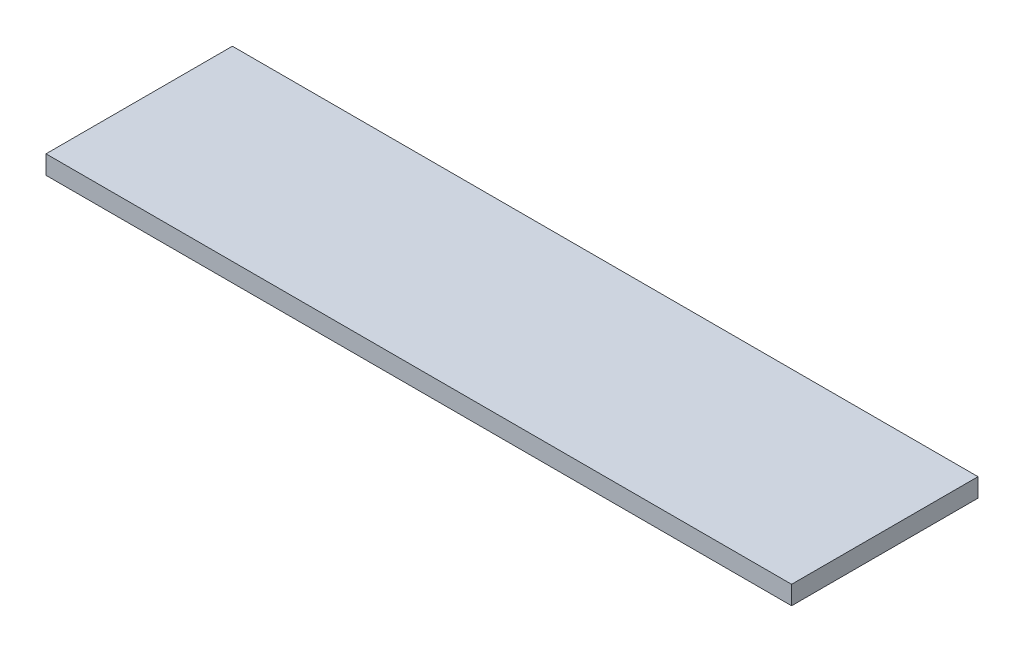
ISO-10303-21;
HEADER;
FILE_DESCRIPTION(('STEP AP214'),'2;1');
FILE_NAME('part.step','',(''),(''),'','','');
FILE_SCHEMA(('AUTOMOTIVE_DESIGN { 1 0 10303 214 1 1 1 1 }'));
ENDSEC;
DATA;
#1=APPLICATION_CONTEXT('core data for automotive mechanical design processes');
#2=APPLICATION_PROTOCOL_DEFINITION('international standard','automotive_design',2000,#1);
#3=PRODUCT_CONTEXT('',#1,'mechanical');
#4=PRODUCT('Part','Part','',(#3));
#5=PRODUCT_RELATED_PRODUCT_CATEGORY('part','',(#4));
#6=PRODUCT_DEFINITION_FORMATION('','',#4);
#7=PRODUCT_DEFINITION_CONTEXT('part definition',#1,'design');
#8=PRODUCT_DEFINITION('design','',#6,#7);
#9=PRODUCT_DEFINITION_SHAPE('','',#8);
#10=(LENGTH_UNIT() NAMED_UNIT(*) SI_UNIT(.MILLI.,.METRE.));
#11=(NAMED_UNIT(*) PLANE_ANGLE_UNIT() SI_UNIT($,.RADIAN.));
#12=(NAMED_UNIT(*) SI_UNIT($,.STERADIAN.) SOLID_ANGLE_UNIT());
#13=UNCERTAINTY_MEASURE_WITH_UNIT(LENGTH_MEASURE(1.E-05),#10,'distance_accuracy_value','');
#14=(GEOMETRIC_REPRESENTATION_CONTEXT(3) GLOBAL_UNCERTAINTY_ASSIGNED_CONTEXT((#13)) GLOBAL_UNIT_ASSIGNED_CONTEXT((#10,
#11,#12)) REPRESENTATION_CONTEXT('',''));
#15=CARTESIAN_POINT('',(0.,0.,0.));
#16=DIRECTION('',(0.,0.,1.));
#17=DIRECTION('',(1.,0.,0.));
#18=AXIS2_PLACEMENT_3D('',#15,#16,#17);
#19=CARTESIAN_POINT('',(400.,20.,-100.));
#20=DIRECTION('',(-1.,0.,0.));
#21=DIRECTION('',(0.,0.,1.));
#22=AXIS2_PLACEMENT_3D('',#19,#20,#21);
#23=PLANE('',#22);
#24=DIRECTION('',(0.,0.,-1.));
#25=VECTOR('',#24,1.);
#26=CARTESIAN_POINT('',(400.,0.,-100.));
#27=LINE('',#26,#25);
#28=CARTESIAN_POINT('',(400.,0.,100.));
#29=VERTEX_POINT('',#28);
#30=CARTESIAN_POINT('',(400.,0.,-100.));
#31=VERTEX_POINT('',#30);
#32=EDGE_CURVE('E100',#29,#31,#27,.T.);
#33=ORIENTED_EDGE('',*,*,#32,.T.);
#34=DIRECTION('',(0.,-1.,0.));
#35=VECTOR('',#34,1.);
#36=CARTESIAN_POINT('',(400.,20.,-100.));
#37=LINE('',#36,#35);
#38=CARTESIAN_POINT('',(400.,20.,-100.));
#39=VERTEX_POINT('',#38);
#40=EDGE_CURVE('E11',#39,#31,#37,.T.);
#41=ORIENTED_EDGE('',*,*,#40,.F.);
#42=DIRECTION('',(0.,0.,-1.));
#43=VECTOR('',#42,1.);
#44=CARTESIAN_POINT('',(400.,20.,-100.));
#45=LINE('',#44,#43);
#46=CARTESIAN_POINT('',(400.,20.,100.));
#47=VERTEX_POINT('',#46);
#48=EDGE_CURVE('E88',#47,#39,#45,.T.);
#49=ORIENTED_EDGE('',*,*,#48,.F.);
#50=DIRECTION('',(0.,-1.,0.));
#51=VECTOR('',#50,1.);
#52=CARTESIAN_POINT('',(400.,20.,100.));
#53=LINE('',#52,#51);
#54=EDGE_CURVE('E96',#47,#29,#53,.T.);
#55=ORIENTED_EDGE('',*,*,#54,.T.);
#56=EDGE_LOOP('',(#33,#41,#49,#55));
#57=FACE_BOUND('',#56,.T.);
#58=ADVANCED_FACE('F37',(#57),#23,.F.);
#59=CARTESIAN_POINT('',(-400.,20.,-100.));
#60=DIRECTION('',(0.,0.,1.));
#61=DIRECTION('',(1.,0.,0.));
#62=AXIS2_PLACEMENT_3D('',#59,#60,#61);
#63=PLANE('',#62);
#64=DIRECTION('',(-1.,0.,0.));
#65=VECTOR('',#64,1.);
#66=CARTESIAN_POINT('',(-400.,0.,-100.));
#67=LINE('',#66,#65);
#68=CARTESIAN_POINT('',(-400.,0.,-100.));
#69=VERTEX_POINT('',#68);
#70=EDGE_CURVE('E92',#31,#69,#67,.T.);
#71=ORIENTED_EDGE('',*,*,#70,.T.);
#72=DIRECTION('',(0.,-1.,0.));
#73=VECTOR('',#72,1.);
#74=CARTESIAN_POINT('',(-400.,20.,-100.));
#75=LINE('',#74,#73);
#76=CARTESIAN_POINT('',(-400.,20.,-100.));
#77=VERTEX_POINT('',#76);
#78=EDGE_CURVE('E45',#77,#69,#75,.T.);
#79=ORIENTED_EDGE('',*,*,#78,.F.);
#80=DIRECTION('',(-1.,0.,0.));
#81=VECTOR('',#80,1.);
#82=CARTESIAN_POINT('',(-400.,20.,-100.));
#83=LINE('',#82,#81);
#84=EDGE_CURVE('E83',#39,#77,#83,.T.);
#85=ORIENTED_EDGE('',*,*,#84,.F.);
#86=ORIENTED_EDGE('',*,*,#40,.T.);
#87=EDGE_LOOP('',(#71,#79,#85,#86));
#88=FACE_BOUND('',#87,.T.);
#89=ADVANCED_FACE('F91',(#88),#63,.F.);
#90=CARTESIAN_POINT('',(-400.,20.,100.));
#91=DIRECTION('',(1.,0.,0.));
#92=DIRECTION('',(0.,0.,-1.));
#93=AXIS2_PLACEMENT_3D('',#90,#91,#92);
#94=PLANE('',#93);
#95=DIRECTION('',(0.,0.,1.));
#96=VECTOR('',#95,1.);
#97=CARTESIAN_POINT('',(-400.,0.,100.));
#98=LINE('',#97,#96);
#99=CARTESIAN_POINT('',(-400.,0.,100.));
#100=VERTEX_POINT('',#99);
#101=EDGE_CURVE('E70',#69,#100,#98,.T.);
#102=ORIENTED_EDGE('',*,*,#101,.T.);
#103=DIRECTION('',(0.,-1.,0.));
#104=VECTOR('',#103,1.);
#105=CARTESIAN_POINT('',(-400.,20.,100.));
#106=LINE('',#105,#104);
#107=CARTESIAN_POINT('',(-400.,20.,100.));
#108=VERTEX_POINT('',#107);
#109=EDGE_CURVE('E93',#108,#100,#106,.T.);
#110=ORIENTED_EDGE('',*,*,#109,.F.);
#111=DIRECTION('',(0.,0.,1.));
#112=VECTOR('',#111,1.);
#113=CARTESIAN_POINT('',(-400.,20.,100.));
#114=LINE('',#113,#112);
#115=EDGE_CURVE('E86',#77,#108,#114,.T.);
#116=ORIENTED_EDGE('',*,*,#115,.F.);
#117=ORIENTED_EDGE('',*,*,#78,.T.);
#118=EDGE_LOOP('',(#102,#110,#116,#117));
#119=FACE_BOUND('',#118,.T.);
#120=ADVANCED_FACE('F94',(#119),#94,.F.);
#121=CARTESIAN_POINT('',(-400.,20.,100.));
#122=DIRECTION('',(0.,0.,-1.));
#123=DIRECTION('',(-1.,0.,0.));
#124=AXIS2_PLACEMENT_3D('',#121,#122,#123);
#125=PLANE('',#124);
#126=DIRECTION('',(1.,0.,0.));
#127=VECTOR('',#126,1.);
#128=CARTESIAN_POINT('',(-400.,0.,100.));
#129=LINE('',#128,#127);
#130=EDGE_CURVE('E76',#100,#29,#129,.T.);
#131=ORIENTED_EDGE('',*,*,#130,.T.);
#132=ORIENTED_EDGE('',*,*,#54,.F.);
#133=DIRECTION('',(1.,0.,0.));
#134=VECTOR('',#133,1.);
#135=CARTESIAN_POINT('',(-400.,20.,100.));
#136=LINE('',#135,#134);
#137=EDGE_CURVE('E53',#108,#47,#136,.T.);
#138=ORIENTED_EDGE('',*,*,#137,.F.);
#139=ORIENTED_EDGE('',*,*,#109,.T.);
#140=EDGE_LOOP('',(#131,#132,#138,#139));
#141=FACE_BOUND('',#140,.T.);
#142=ADVANCED_FACE('F107',(#141),#125,.F.);
#143=CARTESIAN_POINT('',(0.,20.,0.));
#144=DIRECTION('',(0.,1.,0.));
#145=DIRECTION('',(0.,0.,1.));
#146=AXIS2_PLACEMENT_3D('',#143,#144,#145);
#147=PLANE('',#146);
#148=ORIENTED_EDGE('',*,*,#48,.T.);
#149=ORIENTED_EDGE('',*,*,#84,.T.);
#150=ORIENTED_EDGE('',*,*,#115,.T.);
#151=ORIENTED_EDGE('',*,*,#137,.T.);
#152=EDGE_LOOP('',(#148,#149,#150,#151));
#153=FACE_BOUND('',#152,.T.);
#154=ADVANCED_FACE('F84',(#153),#147,.T.);
#155=CARTESIAN_POINT('',(0.,0.,0.));
#156=DIRECTION('',(0.,1.,0.));
#157=DIRECTION('',(0.,0.,1.));
#158=AXIS2_PLACEMENT_3D('',#155,#156,#157);
#159=PLANE('',#158);
#160=ORIENTED_EDGE('',*,*,#32,.F.);
#161=ORIENTED_EDGE('',*,*,#130,.F.);
#162=ORIENTED_EDGE('',*,*,#101,.F.);
#163=ORIENTED_EDGE('',*,*,#70,.F.);
#164=EDGE_LOOP('',(#160,#161,#162,#163));
#165=FACE_BOUND('',#164,.T.);
#166=ADVANCED_FACE('F110',(#165),#159,.F.);
#167=CLOSED_SHELL('',(#58,#89,#120,#142,#154,#166));
#168=MANIFOLD_SOLID_BREP('B2',#167);
#169=ADVANCED_BREP_SHAPE_REPRESENTATION('',(#18,#168),#14);
#170=SHAPE_DEFINITION_REPRESENTATION(#9,#169);
ENDSEC;
END-ISO-10303-21;
